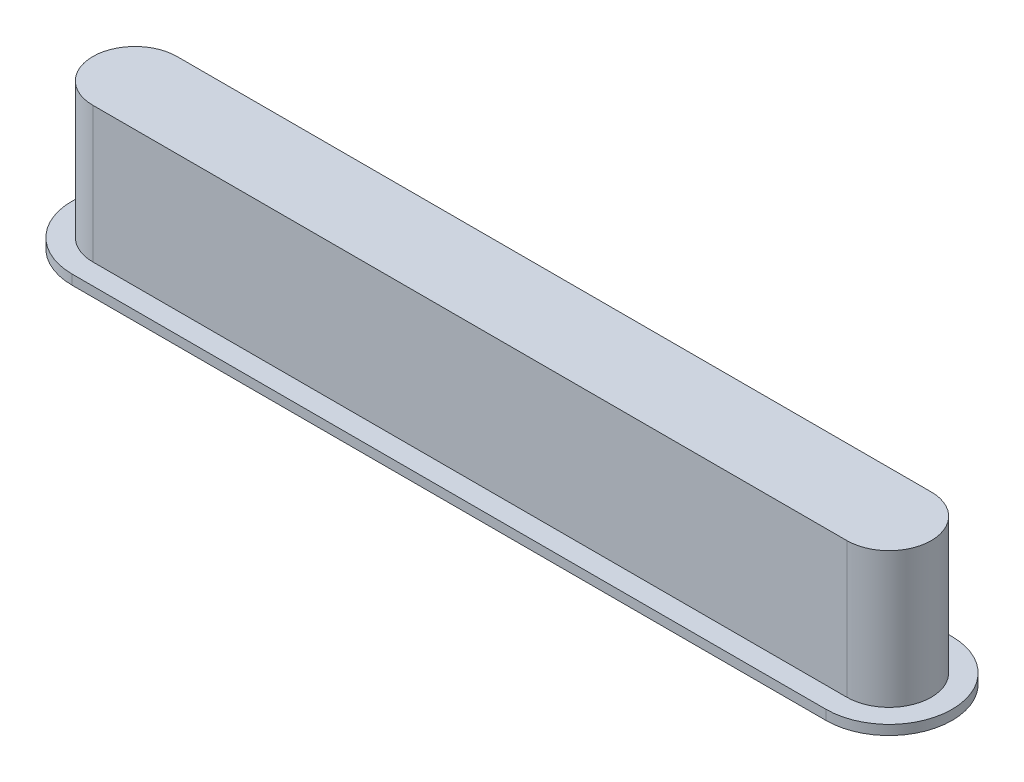
ISO-10303-21;
HEADER;
FILE_DESCRIPTION(('STEP AP214'),'2;1');
FILE_NAME('part.step','',(''),(''),'','','');
FILE_SCHEMA(('AUTOMOTIVE_DESIGN { 1 0 10303 214 1 1 1 1 }'));
ENDSEC;
DATA;
#1=APPLICATION_CONTEXT('core data for automotive mechanical design processes');
#2=APPLICATION_PROTOCOL_DEFINITION('international standard','automotive_design',2000,#1);
#3=PRODUCT_CONTEXT('',#1,'mechanical');
#4=PRODUCT('Part','Part','',(#3));
#5=PRODUCT_RELATED_PRODUCT_CATEGORY('part','',(#4));
#6=PRODUCT_DEFINITION_FORMATION('','',#4);
#7=PRODUCT_DEFINITION_CONTEXT('part definition',#1,'design');
#8=PRODUCT_DEFINITION('design','',#6,#7);
#9=PRODUCT_DEFINITION_SHAPE('','',#8);
#10=(LENGTH_UNIT() NAMED_UNIT(*) SI_UNIT(.MILLI.,.METRE.));
#11=(NAMED_UNIT(*) PLANE_ANGLE_UNIT() SI_UNIT($,.RADIAN.));
#12=(NAMED_UNIT(*) SI_UNIT($,.STERADIAN.) SOLID_ANGLE_UNIT());
#13=UNCERTAINTY_MEASURE_WITH_UNIT(LENGTH_MEASURE(1.E-05),#10,'distance_accuracy_value','');
#14=(GEOMETRIC_REPRESENTATION_CONTEXT(3) GLOBAL_UNCERTAINTY_ASSIGNED_CONTEXT((#13)) GLOBAL_UNIT_ASSIGNED_CONTEXT((#10,
#11,#12)) REPRESENTATION_CONTEXT('',''));
#15=CARTESIAN_POINT('',(0.,0.,0.));
#16=DIRECTION('',(0.,0.,1.));
#17=DIRECTION('',(1.,0.,0.));
#18=AXIS2_PLACEMENT_3D('',#15,#16,#17);
#19=CARTESIAN_POINT('',(-9.8806,3.556,0.));
#20=DIRECTION('',(0.,-1.,0.));
#21=DIRECTION('',(0.,0.,-1.));
#22=AXIS2_PLACEMENT_3D('',#19,#20,#21);
#23=CYLINDRICAL_SURFACE('',#22,1.1049);
#24=CARTESIAN_POINT('',(-9.8806,0.,0.));
#25=DIRECTION('',(0.,1.,0.));
#26=DIRECTION('',(0.,0.,1.));
#27=AXIS2_PLACEMENT_3D('',#24,#25,#26);
#28=CIRCLE('',#27,1.1049);
#29=CARTESIAN_POINT('',(-9.8806,0.,-1.1049));
#30=VERTEX_POINT('',#29);
#31=CARTESIAN_POINT('',(-9.8806,0.,1.1049));
#32=VERTEX_POINT('',#31);
#33=EDGE_CURVE('E136',#30,#32,#28,.T.);
#34=ORIENTED_EDGE('',*,*,#33,.T.);
#35=DIRECTION('',(0.,-1.,0.));
#36=VECTOR('',#35,1.);
#37=CARTESIAN_POINT('',(-9.8806,3.556,1.1049));
#38=LINE('',#37,#36);
#39=CARTESIAN_POINT('',(-9.8806,3.556,1.1049));
#40=VERTEX_POINT('',#39);
#41=EDGE_CURVE('E11',#40,#32,#38,.T.);
#42=ORIENTED_EDGE('',*,*,#41,.F.);
#43=CARTESIAN_POINT('',(-9.8806,3.556,0.));
#44=DIRECTION('',(0.,1.,0.));
#45=DIRECTION('',(0.,0.,1.));
#46=AXIS2_PLACEMENT_3D('',#43,#44,#45);
#47=CIRCLE('',#46,1.1049);
#48=CARTESIAN_POINT('',(-9.8806,3.556,-1.1049));
#49=VERTEX_POINT('',#48);
#50=EDGE_CURVE('E140',#49,#40,#47,.T.);
#51=ORIENTED_EDGE('',*,*,#50,.F.);
#52=DIRECTION('',(0.,-1.,0.));
#53=VECTOR('',#52,1.);
#54=CARTESIAN_POINT('',(-9.8806,3.556,-1.1049));
#55=LINE('',#54,#53);
#56=EDGE_CURVE('E148',#49,#30,#55,.T.);
#57=ORIENTED_EDGE('',*,*,#56,.T.);
#58=EDGE_LOOP('',(#34,#42,#51,#57));
#59=FACE_BOUND('',#58,.T.);
#60=ADVANCED_FACE('F37',(#59),#23,.T.);
#61=CARTESIAN_POINT('',(-9.8806,3.556,1.1049));
#62=DIRECTION('',(0.,0.,-1.));
#63=DIRECTION('',(-1.,0.,0.));
#64=AXIS2_PLACEMENT_3D('',#61,#62,#63);
#65=PLANE('',#64);
#66=DIRECTION('',(1.,0.,0.));
#67=VECTOR('',#66,1.);
#68=CARTESIAN_POINT('',(-9.8806,0.,1.1049));
#69=LINE('',#68,#67);
#70=CARTESIAN_POINT('',(9.8806,0.,1.1049));
#71=VERTEX_POINT('',#70);
#72=EDGE_CURVE('E151',#32,#71,#69,.T.);
#73=ORIENTED_EDGE('',*,*,#72,.T.);
#74=DIRECTION('',(0.,-1.,0.));
#75=VECTOR('',#74,1.);
#76=CARTESIAN_POINT('',(9.8806,3.556,1.1049));
#77=LINE('',#76,#75);
#78=CARTESIAN_POINT('',(9.8806,3.556,1.1049));
#79=VERTEX_POINT('',#78);
#80=EDGE_CURVE('E45',#79,#71,#77,.T.);
#81=ORIENTED_EDGE('',*,*,#80,.F.);
#82=DIRECTION('',(1.,0.,0.));
#83=VECTOR('',#82,1.);
#84=CARTESIAN_POINT('',(-9.8806,3.556,1.1049));
#85=LINE('',#84,#83);
#86=EDGE_CURVE('E142',#40,#79,#85,.T.);
#87=ORIENTED_EDGE('',*,*,#86,.F.);
#88=ORIENTED_EDGE('',*,*,#41,.T.);
#89=EDGE_LOOP('',(#73,#81,#87,#88));
#90=FACE_BOUND('',#89,.T.);
#91=ADVANCED_FACE('F171',(#90),#65,.F.);
#92=CARTESIAN_POINT('',(9.8806,3.556,0.));
#93=DIRECTION('',(0.,-1.,0.));
#94=DIRECTION('',(0.,0.,-1.));
#95=AXIS2_PLACEMENT_3D('',#92,#93,#94);
#96=CYLINDRICAL_SURFACE('',#95,1.1049);
#97=CARTESIAN_POINT('',(9.8806,0.,0.));
#98=DIRECTION('',(0.,1.,0.));
#99=DIRECTION('',(0.,0.,1.));
#100=AXIS2_PLACEMENT_3D('',#97,#98,#99);
#101=CIRCLE('',#100,1.1049);
#102=CARTESIAN_POINT('',(9.8806,0.,-1.1049));
#103=VERTEX_POINT('',#102);
#104=EDGE_CURVE('E154',#71,#103,#101,.T.);
#105=ORIENTED_EDGE('',*,*,#104,.T.);
#106=DIRECTION('',(0.,-1.,0.));
#107=VECTOR('',#106,1.);
#108=CARTESIAN_POINT('',(9.8806,3.556,-1.1049));
#109=LINE('',#108,#107);
#110=CARTESIAN_POINT('',(9.8806,3.556,-1.1049));
#111=VERTEX_POINT('',#110);
#112=EDGE_CURVE('E161',#111,#103,#109,.T.);
#113=ORIENTED_EDGE('',*,*,#112,.F.);
#114=CARTESIAN_POINT('',(9.8806,3.556,0.));
#115=DIRECTION('',(0.,1.,0.));
#116=DIRECTION('',(0.,0.,1.));
#117=AXIS2_PLACEMENT_3D('',#114,#115,#116);
#118=CIRCLE('',#117,1.1049);
#119=EDGE_CURVE('E145',#79,#111,#118,.T.);
#120=ORIENTED_EDGE('',*,*,#119,.F.);
#121=ORIENTED_EDGE('',*,*,#80,.T.);
#122=EDGE_LOOP('',(#105,#113,#120,#121));
#123=FACE_BOUND('',#122,.T.);
#124=ADVANCED_FACE('F167',(#123),#96,.T.);
#125=CARTESIAN_POINT('',(-9.8806,3.556,-1.1049));
#126=DIRECTION('',(0.,0.,1.));
#127=DIRECTION('',(1.,0.,0.));
#128=AXIS2_PLACEMENT_3D('',#125,#126,#127);
#129=PLANE('',#128);
#130=DIRECTION('',(-1.,0.,0.));
#131=VECTOR('',#130,1.);
#132=CARTESIAN_POINT('',(-9.8806,0.,-1.1049));
#133=LINE('',#132,#131);
#134=EDGE_CURVE('E143',#103,#30,#133,.T.);
#135=ORIENTED_EDGE('',*,*,#134,.T.);
#136=ORIENTED_EDGE('',*,*,#56,.F.);
#137=DIRECTION('',(-1.,0.,0.));
#138=VECTOR('',#137,1.);
#139=CARTESIAN_POINT('',(-9.8806,3.556,-1.1049));
#140=LINE('',#139,#138);
#141=EDGE_CURVE('E52',#111,#49,#140,.T.);
#142=ORIENTED_EDGE('',*,*,#141,.F.);
#143=ORIENTED_EDGE('',*,*,#112,.T.);
#144=EDGE_LOOP('',(#135,#136,#142,#143));
#145=FACE_BOUND('',#144,.T.);
#146=ADVANCED_FACE('F176',(#145),#129,.F.);
#147=CARTESIAN_POINT('',(-9.8806,3.556,0.));
#148=DIRECTION('',(0.,1.,0.));
#149=DIRECTION('',(0.,0.,1.));
#150=AXIS2_PLACEMENT_3D('',#147,#148,#149);
#151=PLANE('',#150);
#152=ORIENTED_EDGE('',*,*,#50,.T.);
#153=ORIENTED_EDGE('',*,*,#86,.T.);
#154=ORIENTED_EDGE('',*,*,#119,.T.);
#155=ORIENTED_EDGE('',*,*,#141,.T.);
#156=EDGE_LOOP('',(#152,#153,#154,#155));
#157=FACE_BOUND('',#156,.T.);
#158=ADVANCED_FACE('F179',(#157),#151,.T.);
#159=CARTESIAN_POINT('',(-9.8806,0.,0.));
#160=DIRECTION('',(0.,1.,0.));
#161=DIRECTION('',(0.,0.,1.));
#162=AXIS2_PLACEMENT_3D('',#159,#160,#161);
#163=PLANE('',#162);
#164=CARTESIAN_POINT('',(-9.8806,0.,0.));
#165=DIRECTION('',(0.,1.,0.));
#166=DIRECTION('',(0.,0.,1.));
#167=AXIS2_PLACEMENT_3D('',#164,#165,#166);
#168=CIRCLE('',#167,1.651);
#169=CARTESIAN_POINT('',(-9.8806,0.,-1.651));
#170=VERTEX_POINT('',#169);
#171=CARTESIAN_POINT('',(-9.8806,0.,1.651));
#172=VERTEX_POINT('',#171);
#173=EDGE_CURVE('E130',#170,#172,#168,.T.);
#174=ORIENTED_EDGE('',*,*,#173,.T.);
#175=DIRECTION('',(1.,0.,0.));
#176=VECTOR('',#175,1.);
#177=CARTESIAN_POINT('',(-9.8806,0.,1.651));
#178=LINE('',#177,#176);
#179=CARTESIAN_POINT('',(9.8806,0.,1.651));
#180=VERTEX_POINT('',#179);
#181=EDGE_CURVE('E102',#172,#180,#178,.T.);
#182=ORIENTED_EDGE('',*,*,#181,.T.);
#183=CARTESIAN_POINT('',(9.8806,0.,0.));
#184=DIRECTION('',(0.,1.,0.));
#185=DIRECTION('',(0.,0.,1.));
#186=AXIS2_PLACEMENT_3D('',#183,#184,#185);
#187=CIRCLE('',#186,1.651);
#188=CARTESIAN_POINT('',(9.8806,0.,-1.651));
#189=VERTEX_POINT('',#188);
#190=EDGE_CURVE('E125',#180,#189,#187,.T.);
#191=ORIENTED_EDGE('',*,*,#190,.T.);
#192=DIRECTION('',(-1.,0.,0.));
#193=VECTOR('',#192,1.);
#194=CARTESIAN_POINT('',(-9.8806,0.,-1.651));
#195=LINE('',#194,#193);
#196=EDGE_CURVE('E122',#189,#170,#195,.T.);
#197=ORIENTED_EDGE('',*,*,#196,.T.);
#198=EDGE_LOOP('',(#174,#182,#191,#197));
#199=FACE_BOUND('',#198,.T.);
#200=ORIENTED_EDGE('',*,*,#33,.F.);
#201=ORIENTED_EDGE('',*,*,#134,.F.);
#202=ORIENTED_EDGE('',*,*,#104,.F.);
#203=ORIENTED_EDGE('',*,*,#72,.F.);
#204=EDGE_LOOP('',(#200,#201,#202,#203));
#205=FACE_BOUND('',#204,.T.);
#206=ADVANCED_FACE('F174',(#199,#205),#163,.T.);
#207=CARTESIAN_POINT('',(-9.8806,-0.254,0.));
#208=DIRECTION('',(0.,1.,0.));
#209=DIRECTION('',(0.,0.,1.));
#210=AXIS2_PLACEMENT_3D('',#207,#208,#209);
#211=CYLINDRICAL_SURFACE('',#210,1.651);
#212=ORIENTED_EDGE('',*,*,#173,.F.);
#213=DIRECTION('',(0.,1.,0.));
#214=VECTOR('',#213,1.);
#215=CARTESIAN_POINT('',(-9.8806,-0.254,-1.651));
#216=LINE('',#215,#214);
#217=CARTESIAN_POINT('',(-9.8806,-0.254,-1.651));
#218=VERTEX_POINT('',#217);
#219=EDGE_CURVE('E121',#218,#170,#216,.T.);
#220=ORIENTED_EDGE('',*,*,#219,.F.);
#221=CARTESIAN_POINT('',(-9.8806,-0.254,0.));
#222=DIRECTION('',(0.,1.,0.));
#223=DIRECTION('',(0.,0.,1.));
#224=AXIS2_PLACEMENT_3D('',#221,#222,#223);
#225=CIRCLE('',#224,1.651);
#226=CARTESIAN_POINT('',(-9.8806,-0.254,1.651));
#227=VERTEX_POINT('',#226);
#228=EDGE_CURVE('E115',#218,#227,#225,.T.);
#229=ORIENTED_EDGE('',*,*,#228,.T.);
#230=DIRECTION('',(0.,1.,0.));
#231=VECTOR('',#230,1.);
#232=CARTESIAN_POINT('',(-9.8806,-0.254,1.651));
#233=LINE('',#232,#231);
#234=EDGE_CURVE('E97',#227,#172,#233,.T.);
#235=ORIENTED_EDGE('',*,*,#234,.T.);
#236=EDGE_LOOP('',(#212,#220,#229,#235));
#237=FACE_BOUND('',#236,.T.);
#238=ADVANCED_FACE('F120',(#237),#211,.T.);
#239=CARTESIAN_POINT('',(-9.8806,-0.254,-1.651));
#240=DIRECTION('',(0.,0.,-1.));
#241=DIRECTION('',(-1.,0.,0.));
#242=AXIS2_PLACEMENT_3D('',#239,#240,#241);
#243=PLANE('',#242);
#244=ORIENTED_EDGE('',*,*,#196,.F.);
#245=DIRECTION('',(0.,1.,0.));
#246=VECTOR('',#245,1.);
#247=CARTESIAN_POINT('',(9.8806,-0.254,-1.651));
#248=LINE('',#247,#246);
#249=CARTESIAN_POINT('',(9.8806,-0.254,-1.651));
#250=VERTEX_POINT('',#249);
#251=EDGE_CURVE('E137',#250,#189,#248,.T.);
#252=ORIENTED_EDGE('',*,*,#251,.F.);
#253=DIRECTION('',(-1.,0.,0.));
#254=VECTOR('',#253,1.);
#255=CARTESIAN_POINT('',(-9.8806,-0.254,-1.651));
#256=LINE('',#255,#254);
#257=EDGE_CURVE('E108',#250,#218,#256,.T.);
#258=ORIENTED_EDGE('',*,*,#257,.T.);
#259=ORIENTED_EDGE('',*,*,#219,.T.);
#260=EDGE_LOOP('',(#244,#252,#258,#259));
#261=FACE_BOUND('',#260,.T.);
#262=ADVANCED_FACE('F222',(#261),#243,.T.);
#263=CARTESIAN_POINT('',(9.8806,-0.254,0.));
#264=DIRECTION('',(0.,1.,0.));
#265=DIRECTION('',(0.,0.,1.));
#266=AXIS2_PLACEMENT_3D('',#263,#264,#265);
#267=CYLINDRICAL_SURFACE('',#266,1.651);
#268=ORIENTED_EDGE('',*,*,#190,.F.);
#269=DIRECTION('',(0.,1.,0.));
#270=VECTOR('',#269,1.);
#271=CARTESIAN_POINT('',(9.8806,-0.254,1.651));
#272=LINE('',#271,#270);
#273=CARTESIAN_POINT('',(9.8806,-0.254,1.651));
#274=VERTEX_POINT('',#273);
#275=EDGE_CURVE('E107',#274,#180,#272,.T.);
#276=ORIENTED_EDGE('',*,*,#275,.F.);
#277=CARTESIAN_POINT('',(9.8806,-0.254,0.));
#278=DIRECTION('',(0.,1.,0.));
#279=DIRECTION('',(0.,0.,1.));
#280=AXIS2_PLACEMENT_3D('',#277,#278,#279);
#281=CIRCLE('',#280,1.651);
#282=EDGE_CURVE('E118',#274,#250,#281,.T.);
#283=ORIENTED_EDGE('',*,*,#282,.T.);
#284=ORIENTED_EDGE('',*,*,#251,.T.);
#285=EDGE_LOOP('',(#268,#276,#283,#284));
#286=FACE_BOUND('',#285,.T.);
#287=ADVANCED_FACE('F231',(#286),#267,.T.);
#288=CARTESIAN_POINT('',(-9.8806,-0.254,1.651));
#289=DIRECTION('',(0.,0.,1.));
#290=DIRECTION('',(1.,0.,0.));
#291=AXIS2_PLACEMENT_3D('',#288,#289,#290);
#292=PLANE('',#291);
#293=ORIENTED_EDGE('',*,*,#181,.F.);
#294=ORIENTED_EDGE('',*,*,#234,.F.);
#295=DIRECTION('',(1.,0.,0.));
#296=VECTOR('',#295,1.);
#297=CARTESIAN_POINT('',(-9.8806,-0.254,1.651));
#298=LINE('',#297,#296);
#299=EDGE_CURVE('E100',#227,#274,#298,.T.);
#300=ORIENTED_EDGE('',*,*,#299,.T.);
#301=ORIENTED_EDGE('',*,*,#275,.T.);
#302=EDGE_LOOP('',(#293,#294,#300,#301));
#303=FACE_BOUND('',#302,.T.);
#304=ADVANCED_FACE('F99',(#303),#292,.T.);
#305=CARTESIAN_POINT('',(-9.8806,-0.254,0.));
#306=DIRECTION('',(0.,1.,0.));
#307=DIRECTION('',(0.,0.,1.));
#308=AXIS2_PLACEMENT_3D('',#305,#306,#307);
#309=PLANE('',#308);
#310=ORIENTED_EDGE('',*,*,#228,.F.);
#311=ORIENTED_EDGE('',*,*,#257,.F.);
#312=ORIENTED_EDGE('',*,*,#282,.F.);
#313=ORIENTED_EDGE('',*,*,#299,.F.);
#314=EDGE_LOOP('',(#310,#311,#312,#313));
#315=FACE_BOUND('',#314,.T.);
#316=ADVANCED_FACE('F113',(#315),#309,.F.);
#317=CLOSED_SHELL('',(#60,#91,#124,#146,#158,#206,#238,#262,#287,#304,#316));
#318=MANIFOLD_SOLID_BREP('B2',#317);
#319=ADVANCED_BREP_SHAPE_REPRESENTATION('',(#18,#318),#14);
#320=SHAPE_DEFINITION_REPRESENTATION(#9,#319);
ENDSEC;
END-ISO-10303-21;
